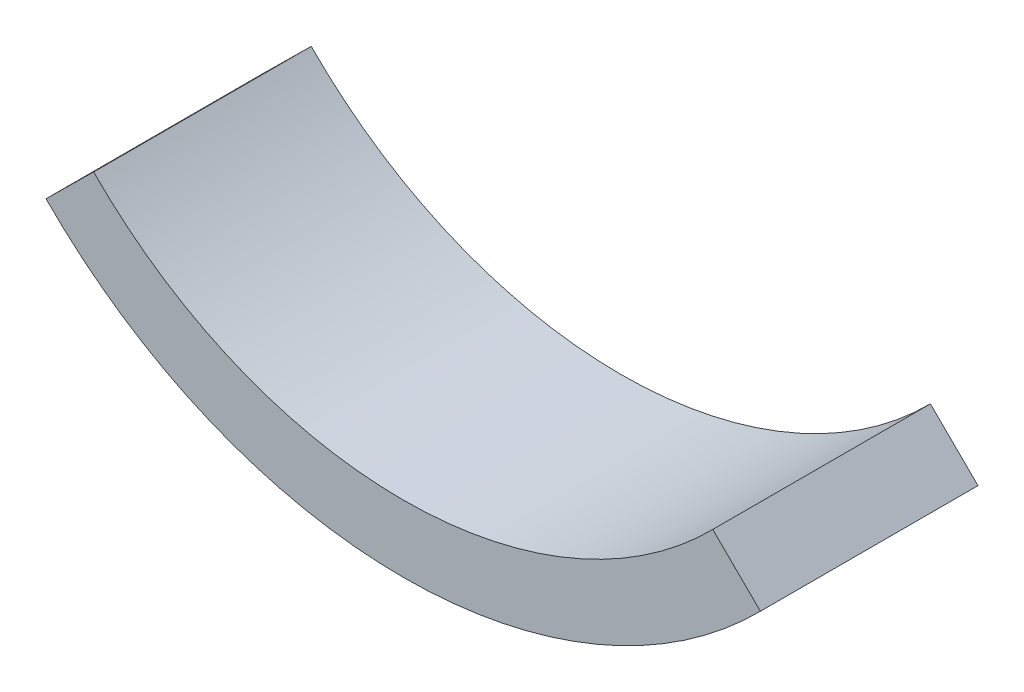
ISO-10303-21;
HEADER;
FILE_DESCRIPTION(('STEP AP214'),'2;1');
FILE_NAME('part.step','',(''),(''),'','','');
FILE_SCHEMA(('AUTOMOTIVE_DESIGN { 1 0 10303 214 1 1 1 1 }'));
ENDSEC;
DATA;
#1=APPLICATION_CONTEXT('core data for automotive mechanical design processes');
#2=APPLICATION_PROTOCOL_DEFINITION('international standard','automotive_design',2000,#1);
#3=PRODUCT_CONTEXT('',#1,'mechanical');
#4=PRODUCT('Part','Part','',(#3));
#5=PRODUCT_RELATED_PRODUCT_CATEGORY('part','',(#4));
#6=PRODUCT_DEFINITION_FORMATION('','',#4);
#7=PRODUCT_DEFINITION_CONTEXT('part definition',#1,'design');
#8=PRODUCT_DEFINITION('design','',#6,#7);
#9=PRODUCT_DEFINITION_SHAPE('','',#8);
#10=(LENGTH_UNIT() NAMED_UNIT(*) SI_UNIT(.MILLI.,.METRE.));
#11=(NAMED_UNIT(*) PLANE_ANGLE_UNIT() SI_UNIT($,.RADIAN.));
#12=(NAMED_UNIT(*) SI_UNIT($,.STERADIAN.) SOLID_ANGLE_UNIT());
#13=UNCERTAINTY_MEASURE_WITH_UNIT(LENGTH_MEASURE(1.E-05),#10,'distance_accuracy_value','');
#14=(GEOMETRIC_REPRESENTATION_CONTEXT(3) GLOBAL_UNCERTAINTY_ASSIGNED_CONTEXT((#13)) GLOBAL_UNIT_ASSIGNED_CONTEXT((#10,
#11,#12)) REPRESENTATION_CONTEXT('',''));
#15=CARTESIAN_POINT('',(0.,0.,0.));
#16=DIRECTION('',(0.,0.,1.));
#17=DIRECTION('',(1.,0.,0.));
#18=AXIS2_PLACEMENT_3D('',#15,#16,#17);
#19=CARTESIAN_POINT('',(0.,0.,13.));
#20=DIRECTION('',(0.,0.,-1.));
#21=DIRECTION('',(-1.,0.,0.));
#22=AXIS2_PLACEMENT_3D('',#19,#20,#21);
#23=CYLINDRICAL_SURFACE('',#22,26.);
#24=CARTESIAN_POINT('',(0.,0.,0.));
#25=DIRECTION('',(0.,0.,-1.));
#26=DIRECTION('',(1.,0.,0.));
#27=AXIS2_PLACEMENT_3D('',#24,#25,#26);
#28=CIRCLE('',#27,26.);
#29=CARTESIAN_POINT('',(18.49541387011,-18.2734689036686,0.));
#30=VERTEX_POINT('',#29);
#31=CARTESIAN_POINT('',(-18.49541387011,-18.2734689036686,0.));
#32=VERTEX_POINT('',#31);
#33=EDGE_CURVE('E113',#30,#32,#28,.T.);
#34=ORIENTED_EDGE('',*,*,#33,.T.);
#35=DIRECTION('',(0.,0.,-1.));
#36=VECTOR('',#35,1.);
#37=CARTESIAN_POINT('',(-18.49541387011,-18.2734689036686,13.));
#38=LINE('',#37,#36);
#39=CARTESIAN_POINT('',(-18.49541387011,-18.2734689036686,13.));
#40=VERTEX_POINT('',#39);
#41=EDGE_CURVE('E11',#40,#32,#38,.T.);
#42=ORIENTED_EDGE('',*,*,#41,.F.);
#43=CARTESIAN_POINT('',(0.,0.,13.));
#44=DIRECTION('',(0.,0.,-1.));
#45=DIRECTION('',(1.,0.,0.));
#46=AXIS2_PLACEMENT_3D('',#43,#44,#45);
#47=CIRCLE('',#46,26.);
#48=CARTESIAN_POINT('',(18.49541387011,-18.2734689036686,13.));
#49=VERTEX_POINT('',#48);
#50=EDGE_CURVE('E97',#49,#40,#47,.T.);
#51=ORIENTED_EDGE('',*,*,#50,.F.);
#52=DIRECTION('',(0.,0.,-1.));
#53=VECTOR('',#52,1.);
#54=CARTESIAN_POINT('',(18.49541387011,-18.2734689036686,13.));
#55=LINE('',#54,#53);
#56=EDGE_CURVE('E109',#49,#30,#55,.T.);
#57=ORIENTED_EDGE('',*,*,#56,.T.);
#58=EDGE_LOOP('',(#34,#42,#51,#57));
#59=FACE_BOUND('',#58,.T.);
#60=ADVANCED_FACE('F45',(#59),#23,.F.);
#61=CARTESIAN_POINT('',(-18.49541387011,-18.2734689036686,13.));
#62=DIRECTION('',(0.702825727064178,-0.711362071927306,0.));
#63=DIRECTION('',(0.711362071927306,0.702825727064178,0.));
#64=AXIS2_PLACEMENT_3D('',#61,#62,#63);
#65=PLANE('',#64);
#66=DIRECTION('',(-0.711362071927306,-0.702825727064178,0.));
#67=VECTOR('',#66,1.);
#68=CARTESIAN_POINT('',(-18.49541387011,-18.2734689036686,0.));
#69=LINE('',#68,#67);
#70=CARTESIAN_POINT('',(-21.3408621578192,-21.0847718119253,0.));
#71=VERTEX_POINT('',#70);
#72=EDGE_CURVE('E102',#32,#71,#69,.T.);
#73=ORIENTED_EDGE('',*,*,#72,.T.);
#74=DIRECTION('',(0.,0.,-1.));
#75=VECTOR('',#74,1.);
#76=CARTESIAN_POINT('',(-21.3408621578192,-21.0847718119253,13.));
#77=LINE('',#76,#75);
#78=CARTESIAN_POINT('',(-21.3408621578192,-21.0847718119253,13.));
#79=VERTEX_POINT('',#78);
#80=EDGE_CURVE('E54',#79,#71,#77,.T.);
#81=ORIENTED_EDGE('',*,*,#80,.F.);
#82=DIRECTION('',(-0.711362071927306,-0.702825727064178,0.));
#83=VECTOR('',#82,1.);
#84=CARTESIAN_POINT('',(-18.49541387011,-18.2734689036686,13.));
#85=LINE('',#84,#83);
#86=EDGE_CURVE('E92',#40,#79,#85,.T.);
#87=ORIENTED_EDGE('',*,*,#86,.F.);
#88=ORIENTED_EDGE('',*,*,#41,.T.);
#89=EDGE_LOOP('',(#73,#81,#87,#88));
#90=FACE_BOUND('',#89,.T.);
#91=ADVANCED_FACE('F101',(#90),#65,.F.);
#92=CARTESIAN_POINT('',(0.,0.,13.));
#93=DIRECTION('',(0.,0.,-1.));
#94=DIRECTION('',(-1.,0.,0.));
#95=AXIS2_PLACEMENT_3D('',#92,#93,#94);
#96=CYLINDRICAL_SURFACE('',#95,30.);
#97=CARTESIAN_POINT('',(0.,0.,0.));
#98=DIRECTION('',(0.,0.,1.));
#99=DIRECTION('',(1.,0.,0.));
#100=AXIS2_PLACEMENT_3D('',#97,#98,#99);
#101=CIRCLE('',#100,30.);
#102=CARTESIAN_POINT('',(21.3408621578192,-21.0847718119253,0.));
#103=VERTEX_POINT('',#102);
#104=EDGE_CURVE('E79',#71,#103,#101,.T.);
#105=ORIENTED_EDGE('',*,*,#104,.T.);
#106=DIRECTION('',(0.,0.,-1.));
#107=VECTOR('',#106,1.);
#108=CARTESIAN_POINT('',(21.3408621578192,-21.0847718119253,13.));
#109=LINE('',#108,#107);
#110=CARTESIAN_POINT('',(21.3408621578192,-21.0847718119253,13.));
#111=VERTEX_POINT('',#110);
#112=EDGE_CURVE('E104',#111,#103,#109,.T.);
#113=ORIENTED_EDGE('',*,*,#112,.F.);
#114=CARTESIAN_POINT('',(0.,0.,13.));
#115=DIRECTION('',(0.,0.,1.));
#116=DIRECTION('',(1.,0.,0.));
#117=AXIS2_PLACEMENT_3D('',#114,#115,#116);
#118=CIRCLE('',#117,30.);
#119=EDGE_CURVE('E95',#79,#111,#118,.T.);
#120=ORIENTED_EDGE('',*,*,#119,.F.);
#121=ORIENTED_EDGE('',*,*,#80,.T.);
#122=EDGE_LOOP('',(#105,#113,#120,#121));
#123=FACE_BOUND('',#122,.T.);
#124=ADVANCED_FACE('F105',(#123),#96,.T.);
#125=CARTESIAN_POINT('',(18.49541387011,-18.2734689036686,13.));
#126=DIRECTION('',(-0.702825727064178,-0.711362071927306,0.));
#127=DIRECTION('',(0.711362071927306,-0.702825727064178,0.));
#128=AXIS2_PLACEMENT_3D('',#125,#126,#127);
#129=PLANE('',#128);
#130=DIRECTION('',(-0.711362071927306,0.702825727064178,0.));
#131=VECTOR('',#130,1.);
#132=CARTESIAN_POINT('',(18.49541387011,-18.2734689036686,0.));
#133=LINE('',#132,#131);
#134=EDGE_CURVE('E85',#103,#30,#133,.T.);
#135=ORIENTED_EDGE('',*,*,#134,.T.);
#136=ORIENTED_EDGE('',*,*,#56,.F.);
#137=DIRECTION('',(-0.711362071927306,0.702825727064178,0.));
#138=VECTOR('',#137,1.);
#139=CARTESIAN_POINT('',(18.49541387011,-18.2734689036686,13.));
#140=LINE('',#139,#138);
#141=EDGE_CURVE('E62',#111,#49,#140,.T.);
#142=ORIENTED_EDGE('',*,*,#141,.F.);
#143=ORIENTED_EDGE('',*,*,#112,.T.);
#144=EDGE_LOOP('',(#135,#136,#142,#143));
#145=FACE_BOUND('',#144,.T.);
#146=ADVANCED_FACE('F126',(#145),#129,.F.);
#147=CARTESIAN_POINT('',(0.,0.,13.));
#148=DIRECTION('',(0.,0.,1.));
#149=DIRECTION('',(1.,0.,0.));
#150=AXIS2_PLACEMENT_3D('',#147,#148,#149);
#151=PLANE('',#150);
#152=ORIENTED_EDGE('',*,*,#50,.T.);
#153=ORIENTED_EDGE('',*,*,#86,.T.);
#154=ORIENTED_EDGE('',*,*,#119,.T.);
#155=ORIENTED_EDGE('',*,*,#141,.T.);
#156=EDGE_LOOP('',(#152,#153,#154,#155));
#157=FACE_BOUND('',#156,.T.);
#158=ADVANCED_FACE('F93',(#157),#151,.T.);
#159=CARTESIAN_POINT('',(0.,0.,0.));
#160=DIRECTION('',(0.,0.,1.));
#161=DIRECTION('',(1.,0.,0.));
#162=AXIS2_PLACEMENT_3D('',#159,#160,#161);
#163=PLANE('',#162);
#164=ORIENTED_EDGE('',*,*,#33,.F.);
#165=ORIENTED_EDGE('',*,*,#134,.F.);
#166=ORIENTED_EDGE('',*,*,#104,.F.);
#167=ORIENTED_EDGE('',*,*,#72,.F.);
#168=EDGE_LOOP('',(#164,#165,#166,#167));
#169=FACE_BOUND('',#168,.T.);
#170=ADVANCED_FACE('F129',(#169),#163,.F.);
#171=CLOSED_SHELL('',(#60,#91,#124,#146,#158,#170));
#172=MANIFOLD_SOLID_BREP('B2',#171);
#173=ADVANCED_BREP_SHAPE_REPRESENTATION('',(#18,#172),#14);
#174=SHAPE_DEFINITION_REPRESENTATION(#9,#173);
ENDSEC;
END-ISO-10303-21;
